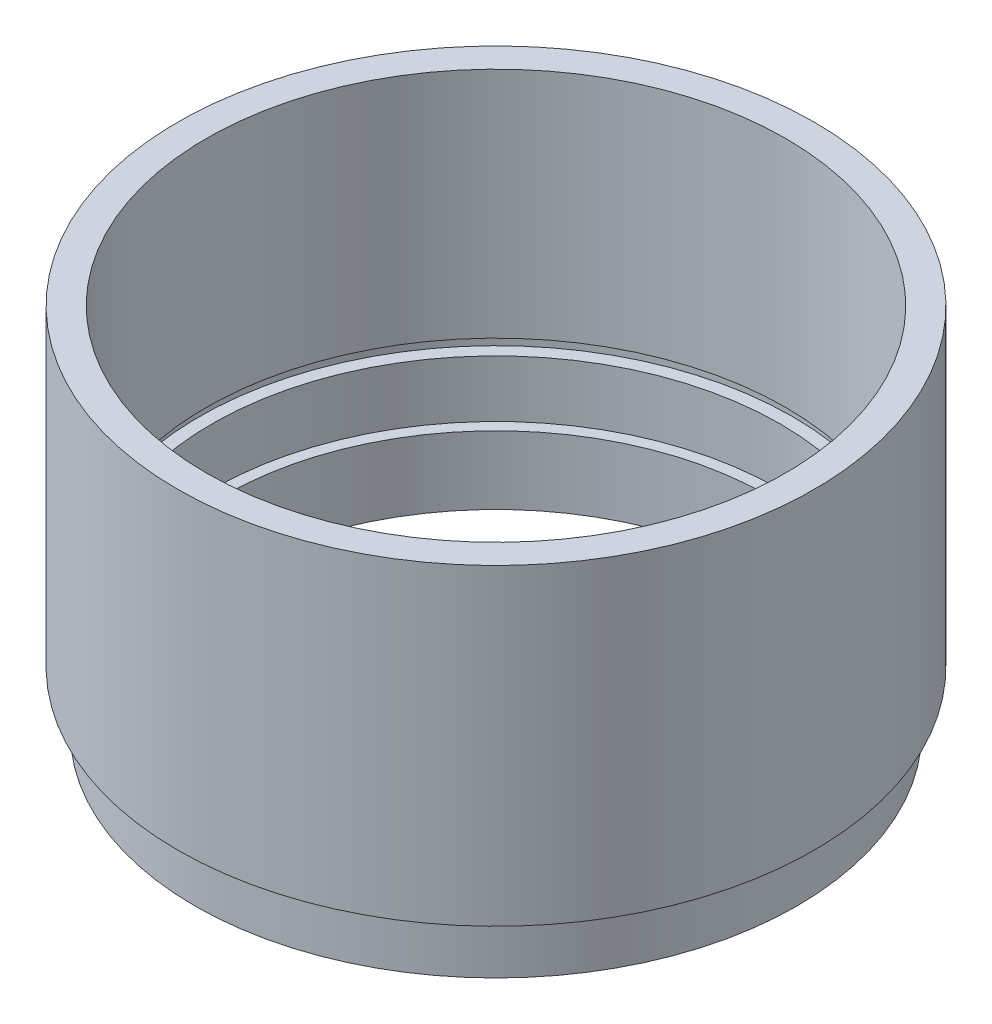
ISO-10303-21;
HEADER;
FILE_DESCRIPTION(('STEP AP214'),'2;1');
FILE_NAME('part.step','',(''),(''),'','','');
FILE_SCHEMA(('AUTOMOTIVE_DESIGN { 1 0 10303 214 1 1 1 1 }'));
ENDSEC;
DATA;
#1=APPLICATION_CONTEXT('core data for automotive mechanical design processes');
#2=APPLICATION_PROTOCOL_DEFINITION('international standard','automotive_design',2000,#1);
#3=PRODUCT_CONTEXT('',#1,'mechanical');
#4=PRODUCT('Part','Part','',(#3));
#5=PRODUCT_RELATED_PRODUCT_CATEGORY('part','',(#4));
#6=PRODUCT_DEFINITION_FORMATION('','',#4);
#7=PRODUCT_DEFINITION_CONTEXT('part definition',#1,'design');
#8=PRODUCT_DEFINITION('design','',#6,#7);
#9=PRODUCT_DEFINITION_SHAPE('','',#8);
#10=(LENGTH_UNIT() NAMED_UNIT(*) SI_UNIT(.MILLI.,.METRE.));
#11=(NAMED_UNIT(*) PLANE_ANGLE_UNIT() SI_UNIT($,.RADIAN.));
#12=(NAMED_UNIT(*) SI_UNIT($,.STERADIAN.) SOLID_ANGLE_UNIT());
#13=UNCERTAINTY_MEASURE_WITH_UNIT(LENGTH_MEASURE(1.E-05),#10,'distance_accuracy_value','');
#14=(GEOMETRIC_REPRESENTATION_CONTEXT(3) GLOBAL_UNCERTAINTY_ASSIGNED_CONTEXT((#13)) GLOBAL_UNIT_ASSIGNED_CONTEXT((#10,
#11,#12)) REPRESENTATION_CONTEXT('',''));
#15=CARTESIAN_POINT('',(0.,0.,0.));
#16=DIRECTION('',(0.,0.,1.));
#17=DIRECTION('',(1.,0.,0.));
#18=AXIS2_PLACEMENT_3D('',#15,#16,#17);
#19=CARTESIAN_POINT('',(0.,0.,0.));
#20=DIRECTION('',(0.,-1.,0.));
#21=DIRECTION('',(0.,0.,-1.));
#22=AXIS2_PLACEMENT_3D('',#19,#20,#21);
#23=CYLINDRICAL_SURFACE('',#22,24.);
#24=CARTESIAN_POINT('',(0.,0.,0.));
#25=DIRECTION('',(0.,-1.,0.));
#26=DIRECTION('',(0.,0.,-1.));
#27=AXIS2_PLACEMENT_3D('',#24,#25,#26);
#28=CIRCLE('',#27,24.);
#29=CARTESIAN_POINT('',(0.,0.,-24.));
#30=VERTEX_POINT('',#29);
#31=EDGE_CURVE('E10',#30,#30,#28,.T.);
#32=ORIENTED_EDGE('',*,*,#31,.T.);
#33=EDGE_LOOP('',(#32));
#34=FACE_BOUND('',#33,.T.);
#35=CARTESIAN_POINT('',(0.,6.,0.));
#36=DIRECTION('',(0.,-1.,0.));
#37=DIRECTION('',(0.,0.,-1.));
#38=AXIS2_PLACEMENT_3D('',#35,#36,#37);
#39=CIRCLE('',#38,24.);
#40=CARTESIAN_POINT('',(0.,6.,-24.));
#41=VERTEX_POINT('',#40);
#42=EDGE_CURVE('E102',#41,#41,#39,.T.);
#43=ORIENTED_EDGE('',*,*,#42,.F.);
#44=EDGE_LOOP('',(#43));
#45=FACE_BOUND('',#44,.T.);
#46=ADVANCED_FACE('F43',(#34,#45),#23,.F.);
#47=CARTESIAN_POINT('',(24.,0.,0.));
#48=DIRECTION('',(0.,-1.,0.));
#49=DIRECTION('',(0.,0.,-1.));
#50=AXIS2_PLACEMENT_3D('',#47,#48,#49);
#51=PLANE('',#50);
#52=CARTESIAN_POINT('',(0.,0.,0.));
#53=DIRECTION('',(0.,-1.,0.));
#54=DIRECTION('',(0.,0.,-1.));
#55=AXIS2_PLACEMENT_3D('',#52,#53,#54);
#56=CIRCLE('',#55,26.5);
#57=CARTESIAN_POINT('',(0.,0.,-26.5));
#58=VERTEX_POINT('',#57);
#59=EDGE_CURVE('E50',#58,#58,#56,.T.);
#60=ORIENTED_EDGE('',*,*,#59,.T.);
#61=EDGE_LOOP('',(#60));
#62=FACE_BOUND('',#61,.T.);
#63=ORIENTED_EDGE('',*,*,#31,.F.);
#64=EDGE_LOOP('',(#63));
#65=FACE_BOUND('',#64,.T.);
#66=ADVANCED_FACE('F111',(#62,#65),#51,.T.);
#67=CARTESIAN_POINT('',(0.,0.,0.));
#68=DIRECTION('',(0.,-1.,0.));
#69=DIRECTION('',(0.,0.,-1.));
#70=AXIS2_PLACEMENT_3D('',#67,#68,#69);
#71=CYLINDRICAL_SURFACE('',#70,26.5);
#72=CARTESIAN_POINT('',(0.,4.,0.));
#73=DIRECTION('',(0.,-1.,0.));
#74=DIRECTION('',(0.,0.,-1.));
#75=AXIS2_PLACEMENT_3D('',#72,#73,#74);
#76=CIRCLE('',#75,26.5);
#77=CARTESIAN_POINT('',(0.,4.,-26.5));
#78=VERTEX_POINT('',#77);
#79=EDGE_CURVE('E57',#78,#78,#76,.T.);
#80=ORIENTED_EDGE('',*,*,#79,.T.);
#81=EDGE_LOOP('',(#80));
#82=FACE_BOUND('',#81,.T.);
#83=ORIENTED_EDGE('',*,*,#59,.F.);
#84=EDGE_LOOP('',(#83));
#85=FACE_BOUND('',#84,.T.);
#86=ADVANCED_FACE('F114',(#82,#85),#71,.T.);
#87=CARTESIAN_POINT('',(26.5,4.,0.));
#88=DIRECTION('',(0.,1.,0.));
#89=DIRECTION('',(0.,0.,1.));
#90=AXIS2_PLACEMENT_3D('',#87,#88,#89);
#91=PLANE('',#90);
#92=CARTESIAN_POINT('',(0.,4.,0.));
#93=DIRECTION('',(0.,-1.,0.));
#94=DIRECTION('',(0.,0.,-1.));
#95=AXIS2_PLACEMENT_3D('',#92,#93,#94);
#96=CIRCLE('',#95,25.5);
#97=CARTESIAN_POINT('',(0.,4.,-25.5));
#98=VERTEX_POINT('',#97);
#99=EDGE_CURVE('E64',#98,#98,#96,.T.);
#100=ORIENTED_EDGE('',*,*,#99,.T.);
#101=EDGE_LOOP('',(#100));
#102=FACE_BOUND('',#101,.T.);
#103=ORIENTED_EDGE('',*,*,#79,.F.);
#104=EDGE_LOOP('',(#103));
#105=FACE_BOUND('',#104,.T.);
#106=ADVANCED_FACE('F117',(#102,#105),#91,.T.);
#107=CARTESIAN_POINT('',(0.,0.,0.));
#108=DIRECTION('',(0.,-1.,0.));
#109=DIRECTION('',(0.,0.,-1.));
#110=AXIS2_PLACEMENT_3D('',#107,#108,#109);
#111=CYLINDRICAL_SURFACE('',#110,25.5);
#112=CARTESIAN_POINT('',(0.,5.,0.));
#113=DIRECTION('',(0.,-1.,0.));
#114=DIRECTION('',(0.,0.,-1.));
#115=AXIS2_PLACEMENT_3D('',#112,#113,#114);
#116=CIRCLE('',#115,25.5);
#117=CARTESIAN_POINT('',(0.,5.,-25.5));
#118=VERTEX_POINT('',#117);
#119=EDGE_CURVE('E70',#118,#118,#116,.T.);
#120=ORIENTED_EDGE('',*,*,#119,.T.);
#121=EDGE_LOOP('',(#120));
#122=FACE_BOUND('',#121,.T.);
#123=ORIENTED_EDGE('',*,*,#99,.F.);
#124=EDGE_LOOP('',(#123));
#125=FACE_BOUND('',#124,.T.);
#126=ADVANCED_FACE('F124',(#122,#125),#111,.T.);
#127=CARTESIAN_POINT('',(25.5,5.,0.));
#128=DIRECTION('',(0.,-1.,0.));
#129=DIRECTION('',(0.,0.,-1.));
#130=AXIS2_PLACEMENT_3D('',#127,#128,#129);
#131=PLANE('',#130);
#132=CARTESIAN_POINT('',(0.,5.,0.));
#133=DIRECTION('',(0.,-1.,0.));
#134=DIRECTION('',(0.,0.,-1.));
#135=AXIS2_PLACEMENT_3D('',#132,#133,#134);
#136=CIRCLE('',#135,28.);
#137=CARTESIAN_POINT('',(0.,5.,-28.));
#138=VERTEX_POINT('',#137);
#139=EDGE_CURVE('E74',#138,#138,#136,.T.);
#140=ORIENTED_EDGE('',*,*,#139,.T.);
#141=EDGE_LOOP('',(#140));
#142=FACE_BOUND('',#141,.T.);
#143=ORIENTED_EDGE('',*,*,#119,.F.);
#144=EDGE_LOOP('',(#143));
#145=FACE_BOUND('',#144,.T.);
#146=ADVANCED_FACE('F128',(#142,#145),#131,.T.);
#147=CARTESIAN_POINT('',(0.,0.,0.));
#148=DIRECTION('',(0.,-1.,0.));
#149=DIRECTION('',(0.,0.,-1.));
#150=AXIS2_PLACEMENT_3D('',#147,#148,#149);
#151=CYLINDRICAL_SURFACE('',#150,28.);
#152=CARTESIAN_POINT('',(0.,32.5,0.));
#153=DIRECTION('',(0.,-1.,0.));
#154=DIRECTION('',(0.,0.,-1.));
#155=AXIS2_PLACEMENT_3D('',#152,#153,#154);
#156=CIRCLE('',#155,28.);
#157=CARTESIAN_POINT('',(0.,32.5,-28.));
#158=VERTEX_POINT('',#157);
#159=EDGE_CURVE('E78',#158,#158,#156,.T.);
#160=ORIENTED_EDGE('',*,*,#159,.T.);
#161=EDGE_LOOP('',(#160));
#162=FACE_BOUND('',#161,.T.);
#163=ORIENTED_EDGE('',*,*,#139,.F.);
#164=EDGE_LOOP('',(#163));
#165=FACE_BOUND('',#164,.T.);
#166=ADVANCED_FACE('F132',(#162,#165),#151,.T.);
#167=CARTESIAN_POINT('',(28.,32.5,0.));
#168=DIRECTION('',(0.,1.,0.));
#169=DIRECTION('',(0.,0.,1.));
#170=AXIS2_PLACEMENT_3D('',#167,#168,#169);
#171=PLANE('',#170);
#172=CARTESIAN_POINT('',(0.,32.5,0.));
#173=DIRECTION('',(0.,-1.,0.));
#174=DIRECTION('',(0.,0.,-1.));
#175=AXIS2_PLACEMENT_3D('',#172,#173,#174);
#176=CIRCLE('',#175,25.5);
#177=CARTESIAN_POINT('',(0.,32.5,-25.5));
#178=VERTEX_POINT('',#177);
#179=EDGE_CURVE('E81',#178,#178,#176,.T.);
#180=ORIENTED_EDGE('',*,*,#179,.T.);
#181=EDGE_LOOP('',(#180));
#182=FACE_BOUND('',#181,.T.);
#183=ORIENTED_EDGE('',*,*,#159,.F.);
#184=EDGE_LOOP('',(#183));
#185=FACE_BOUND('',#184,.T.);
#186=ADVANCED_FACE('F136',(#182,#185),#171,.T.);
#187=CARTESIAN_POINT('',(0.,0.,0.));
#188=DIRECTION('',(0.,-1.,0.));
#189=DIRECTION('',(0.,0.,-1.));
#190=AXIS2_PLACEMENT_3D('',#187,#188,#189);
#191=CYLINDRICAL_SURFACE('',#190,25.5);
#192=CARTESIAN_POINT('',(0.,12.,0.));
#193=DIRECTION('',(0.,-1.,0.));
#194=DIRECTION('',(0.,0.,-1.));
#195=AXIS2_PLACEMENT_3D('',#192,#193,#194);
#196=CIRCLE('',#195,25.5);
#197=CARTESIAN_POINT('',(0.,12.,-25.5));
#198=VERTEX_POINT('',#197);
#199=EDGE_CURVE('E84',#198,#198,#196,.T.);
#200=ORIENTED_EDGE('',*,*,#199,.T.);
#201=EDGE_LOOP('',(#200));
#202=FACE_BOUND('',#201,.T.);
#203=ORIENTED_EDGE('',*,*,#179,.F.);
#204=EDGE_LOOP('',(#203));
#205=FACE_BOUND('',#204,.T.);
#206=ADVANCED_FACE('F140',(#202,#205),#191,.F.);
#207=CARTESIAN_POINT('',(25.5,12.,0.));
#208=DIRECTION('',(0.,-1.,0.));
#209=DIRECTION('',(0.,0.,-1.));
#210=AXIS2_PLACEMENT_3D('',#207,#208,#209);
#211=PLANE('',#210);
#212=CARTESIAN_POINT('',(0.,12.,0.));
#213=DIRECTION('',(0.,-1.,0.));
#214=DIRECTION('',(0.,0.,-1.));
#215=AXIS2_PLACEMENT_3D('',#212,#213,#214);
#216=CIRCLE('',#215,26.1);
#217=CARTESIAN_POINT('',(0.,12.,-26.1));
#218=VERTEX_POINT('',#217);
#219=EDGE_CURVE('E88',#218,#218,#216,.T.);
#220=ORIENTED_EDGE('',*,*,#219,.T.);
#221=EDGE_LOOP('',(#220));
#222=FACE_BOUND('',#221,.T.);
#223=ORIENTED_EDGE('',*,*,#199,.F.);
#224=EDGE_LOOP('',(#223));
#225=FACE_BOUND('',#224,.T.);
#226=ADVANCED_FACE('F144',(#222,#225),#211,.T.);
#227=CARTESIAN_POINT('',(0.,0.,0.));
#228=DIRECTION('',(0.,-1.,0.));
#229=DIRECTION('',(0.,0.,-1.));
#230=AXIS2_PLACEMENT_3D('',#227,#228,#229);
#231=CYLINDRICAL_SURFACE('',#230,26.1);
#232=CARTESIAN_POINT('',(0.,11.,0.));
#233=DIRECTION('',(0.,-1.,0.));
#234=DIRECTION('',(0.,0.,-1.));
#235=AXIS2_PLACEMENT_3D('',#232,#233,#234);
#236=CIRCLE('',#235,26.1);
#237=CARTESIAN_POINT('',(0.,11.,-26.1));
#238=VERTEX_POINT('',#237);
#239=EDGE_CURVE('E92',#238,#238,#236,.T.);
#240=ORIENTED_EDGE('',*,*,#239,.T.);
#241=EDGE_LOOP('',(#240));
#242=FACE_BOUND('',#241,.T.);
#243=ORIENTED_EDGE('',*,*,#219,.F.);
#244=EDGE_LOOP('',(#243));
#245=FACE_BOUND('',#244,.T.);
#246=ADVANCED_FACE('F148',(#242,#245),#231,.F.);
#247=CARTESIAN_POINT('',(26.1,11.,0.));
#248=DIRECTION('',(0.,1.,0.));
#249=DIRECTION('',(0.,0.,1.));
#250=AXIS2_PLACEMENT_3D('',#247,#248,#249);
#251=PLANE('',#250);
#252=CARTESIAN_POINT('',(0.,11.,0.));
#253=DIRECTION('',(0.,-1.,0.));
#254=DIRECTION('',(0.,0.,-1.));
#255=AXIS2_PLACEMENT_3D('',#252,#253,#254);
#256=CIRCLE('',#255,25.);
#257=CARTESIAN_POINT('',(0.,11.,-25.));
#258=VERTEX_POINT('',#257);
#259=EDGE_CURVE('E96',#258,#258,#256,.T.);
#260=ORIENTED_EDGE('',*,*,#259,.T.);
#261=EDGE_LOOP('',(#260));
#262=FACE_BOUND('',#261,.T.);
#263=ORIENTED_EDGE('',*,*,#239,.F.);
#264=EDGE_LOOP('',(#263));
#265=FACE_BOUND('',#264,.T.);
#266=ADVANCED_FACE('F152',(#262,#265),#251,.T.);
#267=CARTESIAN_POINT('',(0.,0.,0.));
#268=DIRECTION('',(0.,-1.,0.));
#269=DIRECTION('',(0.,0.,-1.));
#270=AXIS2_PLACEMENT_3D('',#267,#268,#269);
#271=CYLINDRICAL_SURFACE('',#270,25.);
#272=CARTESIAN_POINT('',(0.,6.,0.));
#273=DIRECTION('',(0.,-1.,0.));
#274=DIRECTION('',(0.,0.,-1.));
#275=AXIS2_PLACEMENT_3D('',#272,#273,#274);
#276=CIRCLE('',#275,25.);
#277=CARTESIAN_POINT('',(0.,6.,-25.));
#278=VERTEX_POINT('',#277);
#279=EDGE_CURVE('E99',#278,#278,#276,.T.);
#280=ORIENTED_EDGE('',*,*,#279,.T.);
#281=EDGE_LOOP('',(#280));
#282=FACE_BOUND('',#281,.T.);
#283=ORIENTED_EDGE('',*,*,#259,.F.);
#284=EDGE_LOOP('',(#283));
#285=FACE_BOUND('',#284,.T.);
#286=ADVANCED_FACE('F156',(#282,#285),#271,.F.);
#287=CARTESIAN_POINT('',(25.,6.,0.));
#288=DIRECTION('',(0.,1.,0.));
#289=DIRECTION('',(0.,0.,1.));
#290=AXIS2_PLACEMENT_3D('',#287,#288,#289);
#291=PLANE('',#290);
#292=ORIENTED_EDGE('',*,*,#42,.T.);
#293=EDGE_LOOP('',(#292));
#294=FACE_BOUND('',#293,.T.);
#295=ORIENTED_EDGE('',*,*,#279,.F.);
#296=EDGE_LOOP('',(#295));
#297=FACE_BOUND('',#296,.T.);
#298=ADVANCED_FACE('F107',(#294,#297),#291,.T.);
#299=CLOSED_SHELL('',(#46,#66,#86,#106,#126,#146,#166,#186,#206,#226,#246,#266,#286,#298));
#300=MANIFOLD_SOLID_BREP('B2',#299);
#301=ADVANCED_BREP_SHAPE_REPRESENTATION('',(#18,#300),#14);
#302=SHAPE_DEFINITION_REPRESENTATION(#9,#301);
ENDSEC;
END-ISO-10303-21;
